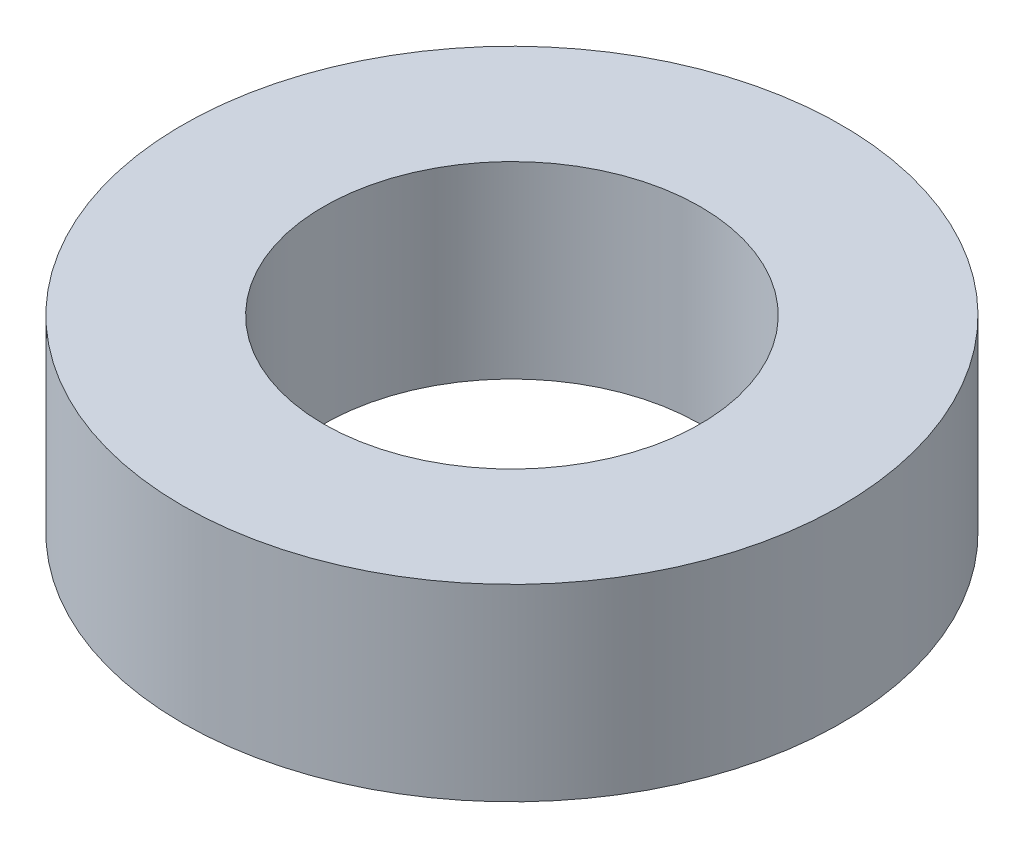
ISO-10303-21;
HEADER;
FILE_DESCRIPTION(('STEP AP214'),'2;1');
FILE_NAME('part.step','',(''),(''),'','','');
FILE_SCHEMA(('AUTOMOTIVE_DESIGN { 1 0 10303 214 1 1 1 1 }'));
ENDSEC;
DATA;
#1=APPLICATION_CONTEXT('core data for automotive mechanical design processes');
#2=APPLICATION_PROTOCOL_DEFINITION('international standard','automotive_design',2000,#1);
#3=PRODUCT_CONTEXT('',#1,'mechanical');
#4=PRODUCT('Part','Part','',(#3));
#5=PRODUCT_RELATED_PRODUCT_CATEGORY('part','',(#4));
#6=PRODUCT_DEFINITION_FORMATION('','',#4);
#7=PRODUCT_DEFINITION_CONTEXT('part definition',#1,'design');
#8=PRODUCT_DEFINITION('design','',#6,#7);
#9=PRODUCT_DEFINITION_SHAPE('','',#8);
#10=(LENGTH_UNIT() NAMED_UNIT(*) SI_UNIT(.MILLI.,.METRE.));
#11=(NAMED_UNIT(*) PLANE_ANGLE_UNIT() SI_UNIT($,.RADIAN.));
#12=(NAMED_UNIT(*) SI_UNIT($,.STERADIAN.) SOLID_ANGLE_UNIT());
#13=UNCERTAINTY_MEASURE_WITH_UNIT(LENGTH_MEASURE(1.E-05),#10,'distance_accuracy_value','');
#14=(GEOMETRIC_REPRESENTATION_CONTEXT(3) GLOBAL_UNCERTAINTY_ASSIGNED_CONTEXT((#13)) GLOBAL_UNIT_ASSIGNED_CONTEXT((#10,
#11,#12)) REPRESENTATION_CONTEXT('',''));
#15=CARTESIAN_POINT('',(0.,0.,0.));
#16=DIRECTION('',(0.,0.,1.));
#17=DIRECTION('',(1.,0.,0.));
#18=AXIS2_PLACEMENT_3D('',#15,#16,#17);
#19=CARTESIAN_POINT('',(0.,10.,0.));
#20=DIRECTION('',(0.,-1.,0.));
#21=DIRECTION('',(0.,0.,-1.));
#22=AXIS2_PLACEMENT_3D('',#19,#20,#21);
#23=CYLINDRICAL_SURFACE('',#22,17.5);
#24=CARTESIAN_POINT('',(0.,10.,0.));
#25=DIRECTION('',(0.,1.,0.));
#26=DIRECTION('',(0.,0.,1.));
#27=AXIS2_PLACEMENT_3D('',#24,#25,#26);
#28=CIRCLE('',#27,17.5);
#29=CARTESIAN_POINT('',(0.,10.,17.5));
#30=VERTEX_POINT('',#29);
#31=EDGE_CURVE('E10',#30,#30,#28,.T.);
#32=ORIENTED_EDGE('',*,*,#31,.F.);
#33=EDGE_LOOP('',(#32));
#34=FACE_BOUND('',#33,.T.);
#35=CARTESIAN_POINT('',(0.,0.,0.));
#36=DIRECTION('',(0.,1.,0.));
#37=DIRECTION('',(0.,0.,1.));
#38=AXIS2_PLACEMENT_3D('',#35,#36,#37);
#39=CIRCLE('',#38,17.5);
#40=CARTESIAN_POINT('',(0.,0.,17.5));
#41=VERTEX_POINT('',#40);
#42=EDGE_CURVE('E37',#41,#41,#39,.T.);
#43=ORIENTED_EDGE('',*,*,#42,.T.);
#44=EDGE_LOOP('',(#43));
#45=FACE_BOUND('',#44,.T.);
#46=ADVANCED_FACE('F40',(#34,#45),#23,.T.);
#47=CARTESIAN_POINT('',(0.,10.,0.));
#48=DIRECTION('',(0.,1.,0.));
#49=DIRECTION('',(0.,0.,1.));
#50=AXIS2_PLACEMENT_3D('',#47,#48,#49);
#51=PLANE('',#50);
#52=CARTESIAN_POINT('',(0.,10.,0.));
#53=DIRECTION('',(0.,1.,0.));
#54=DIRECTION('',(0.,0.,1.));
#55=AXIS2_PLACEMENT_3D('',#52,#53,#54);
#56=CIRCLE('',#55,10.);
#57=CARTESIAN_POINT('',(0.,10.,10.));
#58=VERTEX_POINT('',#57);
#59=EDGE_CURVE('E50',#58,#58,#56,.T.);
#60=ORIENTED_EDGE('',*,*,#59,.F.);
#61=EDGE_LOOP('',(#60));
#62=FACE_BOUND('',#61,.T.);
#63=ORIENTED_EDGE('',*,*,#31,.T.);
#64=EDGE_LOOP('',(#63));
#65=FACE_BOUND('',#64,.T.);
#66=ADVANCED_FACE('F59',(#62,#65),#51,.T.);
#67=CARTESIAN_POINT('',(0.,0.,0.));
#68=DIRECTION('',(0.,1.,0.));
#69=DIRECTION('',(0.,0.,1.));
#70=AXIS2_PLACEMENT_3D('',#67,#68,#69);
#71=PLANE('',#70);
#72=CARTESIAN_POINT('',(0.,0.,0.));
#73=DIRECTION('',(0.,1.,0.));
#74=DIRECTION('',(0.,0.,1.));
#75=AXIS2_PLACEMENT_3D('',#72,#73,#74);
#76=CIRCLE('',#75,10.);
#77=CARTESIAN_POINT('',(0.,0.,10.));
#78=VERTEX_POINT('',#77);
#79=EDGE_CURVE('E47',#78,#78,#76,.T.);
#80=ORIENTED_EDGE('',*,*,#79,.T.);
#81=EDGE_LOOP('',(#80));
#82=FACE_BOUND('',#81,.T.);
#83=ORIENTED_EDGE('',*,*,#42,.F.);
#84=EDGE_LOOP('',(#83));
#85=FACE_BOUND('',#84,.T.);
#86=ADVANCED_FACE('F58',(#82,#85),#71,.F.);
#87=CARTESIAN_POINT('',(0.,10.,0.));
#88=DIRECTION('',(0.,-1.,0.));
#89=DIRECTION('',(0.,0.,-1.));
#90=AXIS2_PLACEMENT_3D('',#87,#88,#89);
#91=CYLINDRICAL_SURFACE('',#90,10.);
#92=ORIENTED_EDGE('',*,*,#59,.T.);
#93=EDGE_LOOP('',(#92));
#94=FACE_BOUND('',#93,.T.);
#95=ORIENTED_EDGE('',*,*,#79,.F.);
#96=EDGE_LOOP('',(#95));
#97=FACE_BOUND('',#96,.T.);
#98=ADVANCED_FACE('F54',(#94,#97),#91,.F.);
#99=CLOSED_SHELL('',(#46,#66,#86,#98));
#100=MANIFOLD_SOLID_BREP('B2',#99);
#101=ADVANCED_BREP_SHAPE_REPRESENTATION('',(#18,#100),#14);
#102=SHAPE_DEFINITION_REPRESENTATION(#9,#101);
ENDSEC;
END-ISO-10303-21;
